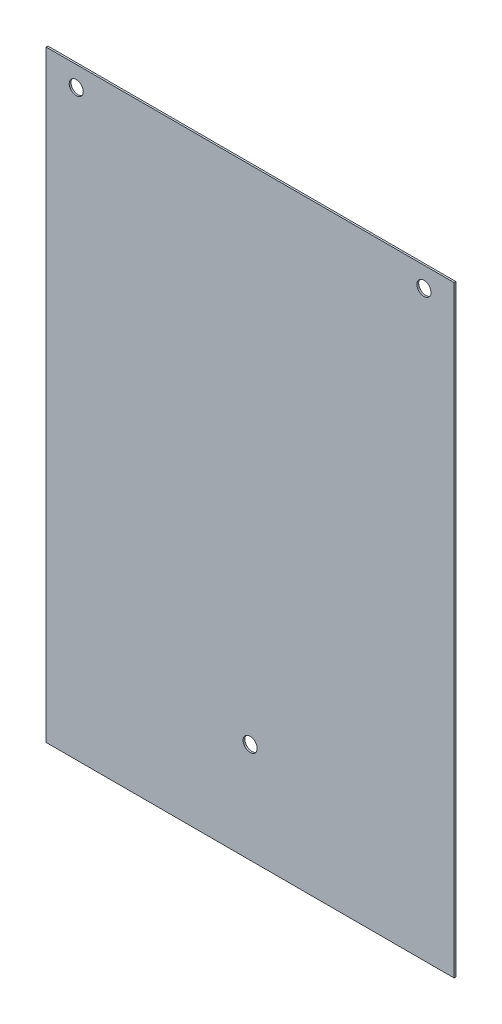
ISO-10303-21;
HEADER;
FILE_DESCRIPTION(('STEP AP214'),'2;1');
FILE_NAME('part.step','',(''),(''),'','','');
FILE_SCHEMA(('AUTOMOTIVE_DESIGN { 1 0 10303 214 1 1 1 1 }'));
ENDSEC;
DATA;
#1=APPLICATION_CONTEXT('core data for automotive mechanical design processes');
#2=APPLICATION_PROTOCOL_DEFINITION('international standard','automotive_design',2000,#1);
#3=PRODUCT_CONTEXT('',#1,'mechanical');
#4=PRODUCT('Part','Part','',(#3));
#5=PRODUCT_RELATED_PRODUCT_CATEGORY('part','',(#4));
#6=PRODUCT_DEFINITION_FORMATION('','',#4);
#7=PRODUCT_DEFINITION_CONTEXT('part definition',#1,'design');
#8=PRODUCT_DEFINITION('design','',#6,#7);
#9=PRODUCT_DEFINITION_SHAPE('','',#8);
#10=(LENGTH_UNIT() NAMED_UNIT(*) SI_UNIT(.MILLI.,.METRE.));
#11=(NAMED_UNIT(*) PLANE_ANGLE_UNIT() SI_UNIT($,.RADIAN.));
#12=(NAMED_UNIT(*) SI_UNIT($,.STERADIAN.) SOLID_ANGLE_UNIT());
#13=UNCERTAINTY_MEASURE_WITH_UNIT(LENGTH_MEASURE(1.E-05),#10,'distance_accuracy_value','');
#14=(GEOMETRIC_REPRESENTATION_CONTEXT(3) GLOBAL_UNCERTAINTY_ASSIGNED_CONTEXT((#13)) GLOBAL_UNIT_ASSIGNED_CONTEXT((#10,
#11,#12)) REPRESENTATION_CONTEXT('',''));
#15=CARTESIAN_POINT('',(0.,0.,0.));
#16=DIRECTION('',(0.,0.,1.));
#17=DIRECTION('',(1.,0.,0.));
#18=AXIS2_PLACEMENT_3D('',#15,#16,#17);
#19=CARTESIAN_POINT('',(101.6,150.,0.9));
#20=DIRECTION('',(-1.,0.,0.));
#21=DIRECTION('',(0.,-1.,0.));
#22=AXIS2_PLACEMENT_3D('',#19,#20,#21);
#23=PLANE('',#22);
#24=DIRECTION('',(0.,1.,0.));
#25=VECTOR('',#24,1.);
#26=CARTESIAN_POINT('',(101.6,150.,0.));
#27=LINE('',#26,#25);
#28=CARTESIAN_POINT('',(101.6,-150.,0.));
#29=VERTEX_POINT('',#28);
#30=CARTESIAN_POINT('',(101.6,150.,0.));
#31=VERTEX_POINT('',#30);
#32=EDGE_CURVE('E97',#29,#31,#27,.T.);
#33=ORIENTED_EDGE('',*,*,#32,.T.);
#34=DIRECTION('',(0.,0.,-1.));
#35=VECTOR('',#34,1.);
#36=CARTESIAN_POINT('',(101.6,150.,0.9));
#37=LINE('',#36,#35);
#38=CARTESIAN_POINT('',(101.6,150.,0.9));
#39=VERTEX_POINT('',#38);
#40=EDGE_CURVE('E11',#39,#31,#37,.T.);
#41=ORIENTED_EDGE('',*,*,#40,.F.);
#42=DIRECTION('',(0.,1.,0.));
#43=VECTOR('',#42,1.);
#44=CARTESIAN_POINT('',(101.6,150.,0.9));
#45=LINE('',#44,#43);
#46=CARTESIAN_POINT('',(101.6,-150.,0.9));
#47=VERTEX_POINT('',#46);
#48=EDGE_CURVE('E85',#47,#39,#45,.T.);
#49=ORIENTED_EDGE('',*,*,#48,.F.);
#50=DIRECTION('',(0.,0.,-1.));
#51=VECTOR('',#50,1.);
#52=CARTESIAN_POINT('',(101.6,-150.,0.9));
#53=LINE('',#52,#51);
#54=EDGE_CURVE('E93',#47,#29,#53,.T.);
#55=ORIENTED_EDGE('',*,*,#54,.T.);
#56=EDGE_LOOP('',(#33,#41,#49,#55));
#57=FACE_BOUND('',#56,.T.);
#58=ADVANCED_FACE('F34',(#57),#23,.F.);
#59=CARTESIAN_POINT('',(-101.6,150.,0.9));
#60=DIRECTION('',(0.,-1.,0.));
#61=DIRECTION('',(0.,0.,-1.));
#62=AXIS2_PLACEMENT_3D('',#59,#60,#61);
#63=PLANE('',#62);
#64=DIRECTION('',(-1.,0.,0.));
#65=VECTOR('',#64,1.);
#66=CARTESIAN_POINT('',(-101.6,150.,0.));
#67=LINE('',#66,#65);
#68=CARTESIAN_POINT('',(-101.6,150.,0.));
#69=VERTEX_POINT('',#68);
#70=EDGE_CURVE('E89',#31,#69,#67,.T.);
#71=ORIENTED_EDGE('',*,*,#70,.T.);
#72=DIRECTION('',(0.,0.,-1.));
#73=VECTOR('',#72,1.);
#74=CARTESIAN_POINT('',(-101.6,150.,0.9));
#75=LINE('',#74,#73);
#76=CARTESIAN_POINT('',(-101.6,150.,0.9));
#77=VERTEX_POINT('',#76);
#78=EDGE_CURVE('E42',#77,#69,#75,.T.);
#79=ORIENTED_EDGE('',*,*,#78,.F.);
#80=DIRECTION('',(-1.,0.,0.));
#81=VECTOR('',#80,1.);
#82=CARTESIAN_POINT('',(-101.6,150.,0.9));
#83=LINE('',#82,#81);
#84=EDGE_CURVE('E80',#39,#77,#83,.T.);
#85=ORIENTED_EDGE('',*,*,#84,.F.);
#86=ORIENTED_EDGE('',*,*,#40,.T.);
#87=EDGE_LOOP('',(#71,#79,#85,#86));
#88=FACE_BOUND('',#87,.T.);
#89=ADVANCED_FACE('F88',(#88),#63,.F.);
#90=CARTESIAN_POINT('',(-101.6,150.,0.9));
#91=DIRECTION('',(1.,0.,0.));
#92=DIRECTION('',(0.,1.,0.));
#93=AXIS2_PLACEMENT_3D('',#90,#91,#92);
#94=PLANE('',#93);
#95=DIRECTION('',(0.,-1.,0.));
#96=VECTOR('',#95,1.);
#97=CARTESIAN_POINT('',(-101.6,150.,0.));
#98=LINE('',#97,#96);
#99=CARTESIAN_POINT('',(-101.6,-150.,0.));
#100=VERTEX_POINT('',#99);
#101=EDGE_CURVE('E67',#69,#100,#98,.T.);
#102=ORIENTED_EDGE('',*,*,#101,.T.);
#103=DIRECTION('',(0.,0.,-1.));
#104=VECTOR('',#103,1.);
#105=CARTESIAN_POINT('',(-101.6,-150.,0.9));
#106=LINE('',#105,#104);
#107=CARTESIAN_POINT('',(-101.6,-150.,0.9));
#108=VERTEX_POINT('',#107);
#109=EDGE_CURVE('E90',#108,#100,#106,.T.);
#110=ORIENTED_EDGE('',*,*,#109,.F.);
#111=DIRECTION('',(0.,-1.,0.));
#112=VECTOR('',#111,1.);
#113=CARTESIAN_POINT('',(-101.6,150.,0.9));
#114=LINE('',#113,#112);
#115=EDGE_CURVE('E83',#77,#108,#114,.T.);
#116=ORIENTED_EDGE('',*,*,#115,.F.);
#117=ORIENTED_EDGE('',*,*,#78,.T.);
#118=EDGE_LOOP('',(#102,#110,#116,#117));
#119=FACE_BOUND('',#118,.T.);
#120=ADVANCED_FACE('F91',(#119),#94,.F.);
#121=CARTESIAN_POINT('',(-101.6,-150.,0.9));
#122=DIRECTION('',(0.,1.,0.));
#123=DIRECTION('',(0.,0.,1.));
#124=AXIS2_PLACEMENT_3D('',#121,#122,#123);
#125=PLANE('',#124);
#126=DIRECTION('',(1.,0.,0.));
#127=VECTOR('',#126,1.);
#128=CARTESIAN_POINT('',(-101.6,-150.,0.));
#129=LINE('',#128,#127);
#130=EDGE_CURVE('E73',#100,#29,#129,.T.);
#131=ORIENTED_EDGE('',*,*,#130,.T.);
#132=ORIENTED_EDGE('',*,*,#54,.F.);
#133=DIRECTION('',(1.,0.,0.));
#134=VECTOR('',#133,1.);
#135=CARTESIAN_POINT('',(-101.6,-150.,0.9));
#136=LINE('',#135,#134);
#137=EDGE_CURVE('E50',#108,#47,#136,.T.);
#138=ORIENTED_EDGE('',*,*,#137,.F.);
#139=ORIENTED_EDGE('',*,*,#109,.T.);
#140=EDGE_LOOP('',(#131,#132,#138,#139));
#141=FACE_BOUND('',#140,.T.);
#142=ADVANCED_FACE('F105',(#141),#125,.F.);
#143=CARTESIAN_POINT('',(0.,0.,0.9));
#144=DIRECTION('',(0.,0.,1.));
#145=DIRECTION('',(1.,0.,0.));
#146=AXIS2_PLACEMENT_3D('',#143,#144,#145);
#147=PLANE('',#146);
#148=CARTESIAN_POINT('',(-86.6,140.,0.9));
#149=DIRECTION('',(0.,0.,1.));
#150=DIRECTION('',(1.,0.,0.));
#151=AXIS2_PLACEMENT_3D('',#148,#149,#150);
#152=CIRCLE('',#151,3.50000000000002);
#153=CARTESIAN_POINT('',(-83.1,140.,0.9));
#154=VERTEX_POINT('',#153);
#155=EDGE_CURVE('E121',#154,#154,#152,.T.);
#156=ORIENTED_EDGE('',*,*,#155,.F.);
#157=EDGE_LOOP('',(#156));
#158=FACE_BOUND('',#157,.T.);
#159=CARTESIAN_POINT('',(86.6,140.,0.9));
#160=DIRECTION('',(0.,0.,1.));
#161=DIRECTION('',(1.,0.,0.));
#162=AXIS2_PLACEMENT_3D('',#159,#160,#161);
#163=CIRCLE('',#162,3.49999999999999);
#164=CARTESIAN_POINT('',(90.1,140.,0.9));
#165=VERTEX_POINT('',#164);
#166=EDGE_CURVE('E114',#165,#165,#163,.T.);
#167=ORIENTED_EDGE('',*,*,#166,.F.);
#168=EDGE_LOOP('',(#167));
#169=FACE_BOUND('',#168,.T.);
#170=CARTESIAN_POINT('',(0.,-100.,0.9));
#171=DIRECTION('',(0.,0.,1.));
#172=DIRECTION('',(1.,0.,0.));
#173=AXIS2_PLACEMENT_3D('',#170,#171,#172);
#174=CIRCLE('',#173,3.5);
#175=CARTESIAN_POINT('',(3.5,-100.,0.9));
#176=VERTEX_POINT('',#175);
#177=EDGE_CURVE('E115',#176,#176,#174,.T.);
#178=ORIENTED_EDGE('',*,*,#177,.F.);
#179=EDGE_LOOP('',(#178));
#180=FACE_BOUND('',#179,.T.);
#181=ORIENTED_EDGE('',*,*,#48,.T.);
#182=ORIENTED_EDGE('',*,*,#84,.T.);
#183=ORIENTED_EDGE('',*,*,#115,.T.);
#184=ORIENTED_EDGE('',*,*,#137,.T.);
#185=EDGE_LOOP('',(#181,#182,#183,#184));
#186=FACE_BOUND('',#185,.T.);
#187=ADVANCED_FACE('F81',(#158,#169,#180,#186),#147,.T.);
#188=CARTESIAN_POINT('',(0.,0.,0.));
#189=DIRECTION('',(0.,0.,1.));
#190=DIRECTION('',(1.,0.,0.));
#191=AXIS2_PLACEMENT_3D('',#188,#189,#190);
#192=PLANE('',#191);
#193=CARTESIAN_POINT('',(-86.6,140.,0.));
#194=DIRECTION('',(0.,0.,1.));
#195=DIRECTION('',(1.,0.,0.));
#196=AXIS2_PLACEMENT_3D('',#193,#194,#195);
#197=CIRCLE('',#196,3.50000000000002);
#198=CARTESIAN_POINT('',(-83.1,140.,0.));
#199=VERTEX_POINT('',#198);
#200=EDGE_CURVE('E100',#199,#199,#197,.F.);
#201=ORIENTED_EDGE('',*,*,#200,.F.);
#202=EDGE_LOOP('',(#201));
#203=FACE_BOUND('',#202,.T.);
#204=CARTESIAN_POINT('',(86.6,140.,0.));
#205=DIRECTION('',(0.,0.,1.));
#206=DIRECTION('',(1.,0.,0.));
#207=AXIS2_PLACEMENT_3D('',#204,#205,#206);
#208=CIRCLE('',#207,3.49999999999999);
#209=CARTESIAN_POINT('',(90.1,140.,0.));
#210=VERTEX_POINT('',#209);
#211=EDGE_CURVE('E118',#210,#210,#208,.F.);
#212=ORIENTED_EDGE('',*,*,#211,.F.);
#213=EDGE_LOOP('',(#212));
#214=FACE_BOUND('',#213,.T.);
#215=CARTESIAN_POINT('',(0.,-100.,0.));
#216=DIRECTION('',(0.,0.,1.));
#217=DIRECTION('',(1.,0.,0.));
#218=AXIS2_PLACEMENT_3D('',#215,#216,#217);
#219=CIRCLE('',#218,3.5);
#220=CARTESIAN_POINT('',(3.5,-100.,0.));
#221=VERTEX_POINT('',#220);
#222=EDGE_CURVE('E111',#221,#221,#219,.F.);
#223=ORIENTED_EDGE('',*,*,#222,.F.);
#224=EDGE_LOOP('',(#223));
#225=FACE_BOUND('',#224,.T.);
#226=ORIENTED_EDGE('',*,*,#32,.F.);
#227=ORIENTED_EDGE('',*,*,#130,.F.);
#228=ORIENTED_EDGE('',*,*,#101,.F.);
#229=ORIENTED_EDGE('',*,*,#70,.F.);
#230=EDGE_LOOP('',(#226,#227,#228,#229));
#231=FACE_BOUND('',#230,.T.);
#232=ADVANCED_FACE('F108',(#203,#214,#225,#231),#192,.F.);
#233=CARTESIAN_POINT('',(0.,-100.,-9.89949493661173));
#234=DIRECTION('',(0.,0.,1.));
#235=DIRECTION('',(1.,0.,0.));
#236=AXIS2_PLACEMENT_3D('',#233,#234,#235);
#237=CYLINDRICAL_SURFACE('',#236,3.5);
#238=ORIENTED_EDGE('',*,*,#222,.T.);
#239=EDGE_LOOP('',(#238));
#240=FACE_BOUND('',#239,.T.);
#241=ORIENTED_EDGE('',*,*,#177,.T.);
#242=EDGE_LOOP('',(#241));
#243=FACE_BOUND('',#242,.T.);
#244=ADVANCED_FACE('F138',(#240,#243),#237,.F.);
#245=CARTESIAN_POINT('',(86.6,140.,-9.89949493661173));
#246=DIRECTION('',(0.,0.,1.));
#247=DIRECTION('',(1.,0.,0.));
#248=AXIS2_PLACEMENT_3D('',#245,#246,#247);
#249=CYLINDRICAL_SURFACE('',#248,3.49999999999999);
#250=ORIENTED_EDGE('',*,*,#211,.T.);
#251=EDGE_LOOP('',(#250));
#252=FACE_BOUND('',#251,.T.);
#253=ORIENTED_EDGE('',*,*,#166,.T.);
#254=EDGE_LOOP('',(#253));
#255=FACE_BOUND('',#254,.T.);
#256=ADVANCED_FACE('F140',(#252,#255),#249,.F.);
#257=CARTESIAN_POINT('',(-86.6,140.,-9.89949493661173));
#258=DIRECTION('',(0.,0.,1.));
#259=DIRECTION('',(1.,0.,0.));
#260=AXIS2_PLACEMENT_3D('',#257,#258,#259);
#261=CYLINDRICAL_SURFACE('',#260,3.50000000000002);
#262=ORIENTED_EDGE('',*,*,#200,.T.);
#263=EDGE_LOOP('',(#262));
#264=FACE_BOUND('',#263,.T.);
#265=ORIENTED_EDGE('',*,*,#155,.T.);
#266=EDGE_LOOP('',(#265));
#267=FACE_BOUND('',#266,.T.);
#268=ADVANCED_FACE('F129',(#264,#267),#261,.F.);
#269=CLOSED_SHELL('',(#58,#89,#120,#142,#187,#232,#244,#256,#268));
#270=MANIFOLD_SOLID_BREP('B2',#269);
#271=ADVANCED_BREP_SHAPE_REPRESENTATION('',(#18,#270),#14);
#272=SHAPE_DEFINITION_REPRESENTATION(#9,#271);
ENDSEC;
END-ISO-10303-21;
